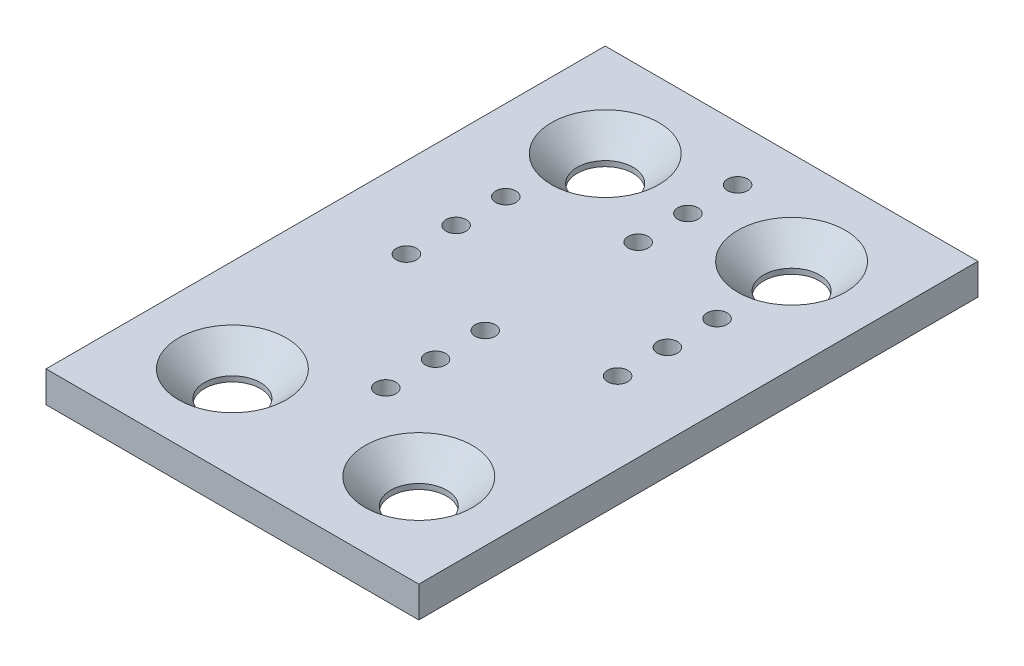
ISO-10303-21;
HEADER;
FILE_DESCRIPTION(('STEP AP214'),'2;1');
FILE_NAME('part.step','',(''),(''),'','','');
FILE_SCHEMA(('AUTOMOTIVE_DESIGN { 1 0 10303 214 1 1 1 1 }'));
ENDSEC;
DATA;
#1=APPLICATION_CONTEXT('core data for automotive mechanical design processes');
#2=APPLICATION_PROTOCOL_DEFINITION('international standard','automotive_design',2000,#1);
#3=PRODUCT_CONTEXT('',#1,'mechanical');
#4=PRODUCT('Part','Part','',(#3));
#5=PRODUCT_RELATED_PRODUCT_CATEGORY('part','',(#4));
#6=PRODUCT_DEFINITION_FORMATION('','',#4);
#7=PRODUCT_DEFINITION_CONTEXT('part definition',#1,'design');
#8=PRODUCT_DEFINITION('design','',#6,#7);
#9=PRODUCT_DEFINITION_SHAPE('','',#8);
#10=(LENGTH_UNIT() NAMED_UNIT(*) SI_UNIT(.MILLI.,.METRE.));
#11=(NAMED_UNIT(*) PLANE_ANGLE_UNIT() SI_UNIT($,.RADIAN.));
#12=(NAMED_UNIT(*) SI_UNIT($,.STERADIAN.) SOLID_ANGLE_UNIT());
#13=UNCERTAINTY_MEASURE_WITH_UNIT(LENGTH_MEASURE(1.E-05),#10,'distance_accuracy_value','');
#14=(GEOMETRIC_REPRESENTATION_CONTEXT(3) GLOBAL_UNCERTAINTY_ASSIGNED_CONTEXT((#13)) GLOBAL_UNIT_ASSIGNED_CONTEXT((#10,
#11,#12)) REPRESENTATION_CONTEXT('',''));
#15=CARTESIAN_POINT('',(0.,0.,0.));
#16=DIRECTION('',(0.,0.,1.));
#17=DIRECTION('',(1.,0.,0.));
#18=AXIS2_PLACEMENT_3D('',#15,#16,#17);
#19=CARTESIAN_POINT('',(0.,5.,45.));
#20=DIRECTION('',(0.,0.,-1.));
#21=DIRECTION('',(-1.,0.,0.));
#22=AXIS2_PLACEMENT_3D('',#19,#20,#21);
#23=PLANE('',#22);
#24=DIRECTION('',(1.,0.,0.));
#25=VECTOR('',#24,1.);
#26=CARTESIAN_POINT('',(0.,0.,45.));
#27=LINE('',#26,#25);
#28=CARTESIAN_POINT('',(-30.,0.,45.));
#29=VERTEX_POINT('',#28);
#30=CARTESIAN_POINT('',(30.,0.,45.));
#31=VERTEX_POINT('',#30);
#32=EDGE_CURVE('E159',#29,#31,#27,.T.);
#33=ORIENTED_EDGE('',*,*,#32,.T.);
#34=DIRECTION('',(0.,-1.,0.));
#35=VECTOR('',#34,1.);
#36=CARTESIAN_POINT('',(30.,5.,45.));
#37=LINE('',#36,#35);
#38=CARTESIAN_POINT('',(30.,5.,45.));
#39=VERTEX_POINT('',#38);
#40=EDGE_CURVE('E11',#39,#31,#37,.T.);
#41=ORIENTED_EDGE('',*,*,#40,.F.);
#42=DIRECTION('',(1.,0.,0.));
#43=VECTOR('',#42,1.);
#44=CARTESIAN_POINT('',(0.,5.,45.));
#45=LINE('',#44,#43);
#46=CARTESIAN_POINT('',(-30.,5.,45.));
#47=VERTEX_POINT('',#46);
#48=EDGE_CURVE('E92',#47,#39,#45,.T.);
#49=ORIENTED_EDGE('',*,*,#48,.F.);
#50=DIRECTION('',(0.,-1.,0.));
#51=VECTOR('',#50,1.);
#52=CARTESIAN_POINT('',(-30.,5.,45.));
#53=LINE('',#52,#51);
#54=EDGE_CURVE('E59',#47,#29,#53,.T.);
#55=ORIENTED_EDGE('',*,*,#54,.T.);
#56=EDGE_LOOP('',(#33,#41,#49,#55));
#57=FACE_BOUND('',#56,.T.);
#58=ADVANCED_FACE('F41',(#57),#23,.F.);
#59=CARTESIAN_POINT('',(30.,5.,0.));
#60=DIRECTION('',(-1.,0.,0.));
#61=DIRECTION('',(0.,0.,1.));
#62=AXIS2_PLACEMENT_3D('',#59,#60,#61);
#63=PLANE('',#62);
#64=DIRECTION('',(0.,0.,-1.));
#65=VECTOR('',#64,1.);
#66=CARTESIAN_POINT('',(30.,0.,0.));
#67=LINE('',#66,#65);
#68=CARTESIAN_POINT('',(30.,0.,-45.));
#69=VERTEX_POINT('',#68);
#70=EDGE_CURVE('E98',#31,#69,#67,.T.);
#71=ORIENTED_EDGE('',*,*,#70,.T.);
#72=DIRECTION('',(0.,-1.,0.));
#73=VECTOR('',#72,1.);
#74=CARTESIAN_POINT('',(30.,5.,-45.));
#75=LINE('',#74,#73);
#76=CARTESIAN_POINT('',(30.,5.,-45.));
#77=VERTEX_POINT('',#76);
#78=EDGE_CURVE('E51',#77,#69,#75,.T.);
#79=ORIENTED_EDGE('',*,*,#78,.F.);
#80=DIRECTION('',(0.,0.,-1.));
#81=VECTOR('',#80,1.);
#82=CARTESIAN_POINT('',(30.,5.,0.));
#83=LINE('',#82,#81);
#84=EDGE_CURVE('E84',#39,#77,#83,.T.);
#85=ORIENTED_EDGE('',*,*,#84,.F.);
#86=ORIENTED_EDGE('',*,*,#40,.T.);
#87=EDGE_LOOP('',(#71,#79,#85,#86));
#88=FACE_BOUND('',#87,.T.);
#89=ADVANCED_FACE('F97',(#88),#63,.F.);
#90=CARTESIAN_POINT('',(0.,5.,-45.));
#91=DIRECTION('',(0.,0.,-1.));
#92=DIRECTION('',(-1.,0.,0.));
#93=AXIS2_PLACEMENT_3D('',#90,#91,#92);
#94=PLANE('',#93);
#95=DIRECTION('',(1.,0.,0.));
#96=VECTOR('',#95,1.);
#97=CARTESIAN_POINT('',(0.,0.,-45.));
#98=LINE('',#97,#96);
#99=CARTESIAN_POINT('',(-30.,0.,-45.));
#100=VERTEX_POINT('',#99);
#101=EDGE_CURVE('E164',#100,#69,#98,.T.);
#102=ORIENTED_EDGE('',*,*,#101,.F.);
#103=DIRECTION('',(0.,-1.,0.));
#104=VECTOR('',#103,1.);
#105=CARTESIAN_POINT('',(-30.,5.,-45.));
#106=LINE('',#105,#104);
#107=CARTESIAN_POINT('',(-30.,5.,-45.));
#108=VERTEX_POINT('',#107);
#109=EDGE_CURVE('E73',#108,#100,#106,.T.);
#110=ORIENTED_EDGE('',*,*,#109,.F.);
#111=DIRECTION('',(1.,0.,0.));
#112=VECTOR('',#111,1.);
#113=CARTESIAN_POINT('',(0.,5.,-45.));
#114=LINE('',#113,#112);
#115=EDGE_CURVE('E91',#108,#77,#114,.T.);
#116=ORIENTED_EDGE('',*,*,#115,.T.);
#117=ORIENTED_EDGE('',*,*,#78,.T.);
#118=EDGE_LOOP('',(#102,#110,#116,#117));
#119=FACE_BOUND('',#118,.T.);
#120=ADVANCED_FACE('F102',(#119),#94,.T.);
#121=CARTESIAN_POINT('',(0.,5.,-28.3090687587975));
#122=DIRECTION('',(0.,-1.,0.));
#123=DIRECTION('',(0.,0.,-1.));
#124=AXIS2_PLACEMENT_3D('',#121,#122,#123);
#125=CYLINDRICAL_SURFACE('',#124,1.625);
#126=CARTESIAN_POINT('',(0.,5.,-28.3090687587975));
#127=DIRECTION('',(0.,1.,0.));
#128=DIRECTION('',(0.,0.,1.));
#129=AXIS2_PLACEMENT_3D('',#126,#127,#128);
#130=CIRCLE('',#129,1.625);
#131=CARTESIAN_POINT('',(0.,5.,-26.6840687587975));
#132=VERTEX_POINT('',#131);
#133=EDGE_CURVE('E224',#132,#132,#130,.T.);
#134=ORIENTED_EDGE('',*,*,#133,.T.);
#135=EDGE_LOOP('',(#134));
#136=FACE_BOUND('',#135,.T.);
#137=CARTESIAN_POINT('',(0.,0.,-28.3090687587975));
#138=DIRECTION('',(0.,1.,0.));
#139=DIRECTION('',(0.,0.,1.));
#140=AXIS2_PLACEMENT_3D('',#137,#138,#139);
#141=CIRCLE('',#140,1.625);
#142=CARTESIAN_POINT('',(0.,0.,-26.6840687587975));
#143=VERTEX_POINT('',#142);
#144=EDGE_CURVE('E155',#143,#143,#141,.T.);
#145=ORIENTED_EDGE('',*,*,#144,.F.);
#146=EDGE_LOOP('',(#145));
#147=FACE_BOUND('',#146,.T.);
#148=ADVANCED_FACE('F230',(#136,#147),#125,.F.);
#149=CARTESIAN_POINT('',(17.,5.,-8.));
#150=DIRECTION('',(0.,-1.,0.));
#151=DIRECTION('',(0.,0.,-1.));
#152=AXIS2_PLACEMENT_3D('',#149,#150,#151);
#153=CYLINDRICAL_SURFACE('',#152,1.625);
#154=CARTESIAN_POINT('',(17.,5.,-8.));
#155=DIRECTION('',(0.,1.,0.));
#156=DIRECTION('',(0.,0.,1.));
#157=AXIS2_PLACEMENT_3D('',#154,#155,#156);
#158=CIRCLE('',#157,1.625);
#159=CARTESIAN_POINT('',(17.,5.,-6.375));
#160=VERTEX_POINT('',#159);
#161=EDGE_CURVE('E220',#160,#160,#158,.T.);
#162=ORIENTED_EDGE('',*,*,#161,.T.);
#163=EDGE_LOOP('',(#162));
#164=FACE_BOUND('',#163,.T.);
#165=CARTESIAN_POINT('',(17.,0.,-8.));
#166=DIRECTION('',(0.,1.,0.));
#167=DIRECTION('',(0.,0.,1.));
#168=AXIS2_PLACEMENT_3D('',#165,#166,#167);
#169=CIRCLE('',#168,1.625);
#170=CARTESIAN_POINT('',(17.,0.,-6.375));
#171=VERTEX_POINT('',#170);
#172=EDGE_CURVE('E151',#171,#171,#169,.T.);
#173=ORIENTED_EDGE('',*,*,#172,.F.);
#174=EDGE_LOOP('',(#173));
#175=FACE_BOUND('',#174,.T.);
#176=ADVANCED_FACE('F259',(#164,#175),#153,.F.);
#177=CARTESIAN_POINT('',(-17.,5.,-8.));
#178=DIRECTION('',(0.,-1.,0.));
#179=DIRECTION('',(0.,0.,-1.));
#180=AXIS2_PLACEMENT_3D('',#177,#178,#179);
#181=CYLINDRICAL_SURFACE('',#180,1.625);
#182=CARTESIAN_POINT('',(-17.,5.,-8.));
#183=DIRECTION('',(0.,1.,0.));
#184=DIRECTION('',(0.,0.,1.));
#185=AXIS2_PLACEMENT_3D('',#182,#183,#184);
#186=CIRCLE('',#185,1.625);
#187=CARTESIAN_POINT('',(-17.,5.,-6.375));
#188=VERTEX_POINT('',#187);
#189=EDGE_CURVE('E216',#188,#188,#186,.T.);
#190=ORIENTED_EDGE('',*,*,#189,.T.);
#191=EDGE_LOOP('',(#190));
#192=FACE_BOUND('',#191,.T.);
#193=CARTESIAN_POINT('',(-17.,0.,-8.));
#194=DIRECTION('',(0.,1.,0.));
#195=DIRECTION('',(0.,0.,1.));
#196=AXIS2_PLACEMENT_3D('',#193,#194,#195);
#197=CIRCLE('',#196,1.625);
#198=CARTESIAN_POINT('',(-17.,0.,-6.375));
#199=VERTEX_POINT('',#198);
#200=EDGE_CURVE('E147',#199,#199,#197,.T.);
#201=ORIENTED_EDGE('',*,*,#200,.F.);
#202=EDGE_LOOP('',(#201));
#203=FACE_BOUND('',#202,.T.);
#204=ADVANCED_FACE('F262',(#192,#203),#181,.F.);
#205=CARTESIAN_POINT('',(0.,5.,-36.3090687587975));
#206=DIRECTION('',(0.,-1.,0.));
#207=DIRECTION('',(0.,0.,-1.));
#208=AXIS2_PLACEMENT_3D('',#205,#206,#207);
#209=CYLINDRICAL_SURFACE('',#208,1.625);
#210=CARTESIAN_POINT('',(0.,5.,-36.3090687587975));
#211=DIRECTION('',(0.,1.,0.));
#212=DIRECTION('',(0.,0.,1.));
#213=AXIS2_PLACEMENT_3D('',#210,#211,#212);
#214=CIRCLE('',#213,1.625);
#215=CARTESIAN_POINT('',(0.,5.,-34.6840687587975));
#216=VERTEX_POINT('',#215);
#217=EDGE_CURVE('E212',#216,#216,#214,.T.);
#218=ORIENTED_EDGE('',*,*,#217,.T.);
#219=EDGE_LOOP('',(#218));
#220=FACE_BOUND('',#219,.T.);
#221=CARTESIAN_POINT('',(0.,0.,-36.3090687587975));
#222=DIRECTION('',(0.,1.,0.));
#223=DIRECTION('',(0.,0.,1.));
#224=AXIS2_PLACEMENT_3D('',#221,#222,#223);
#225=CIRCLE('',#224,1.625);
#226=CARTESIAN_POINT('',(0.,0.,-34.6840687587975));
#227=VERTEX_POINT('',#226);
#228=EDGE_CURVE('E143',#227,#227,#225,.T.);
#229=ORIENTED_EDGE('',*,*,#228,.F.);
#230=EDGE_LOOP('',(#229));
#231=FACE_BOUND('',#230,.T.);
#232=ADVANCED_FACE('F266',(#220,#231),#209,.F.);
#233=CARTESIAN_POINT('',(16.9999999999999,5.,-16.));
#234=DIRECTION('',(0.,-1.,0.));
#235=DIRECTION('',(0.,0.,-1.));
#236=AXIS2_PLACEMENT_3D('',#233,#234,#235);
#237=CYLINDRICAL_SURFACE('',#236,1.625);
#238=CARTESIAN_POINT('',(16.9999999999999,5.,-16.));
#239=DIRECTION('',(0.,1.,0.));
#240=DIRECTION('',(0.,0.,1.));
#241=AXIS2_PLACEMENT_3D('',#238,#239,#240);
#242=CIRCLE('',#241,1.625);
#243=CARTESIAN_POINT('',(16.9999999999999,5.,-14.375));
#244=VERTEX_POINT('',#243);
#245=EDGE_CURVE('E208',#244,#244,#242,.T.);
#246=ORIENTED_EDGE('',*,*,#245,.T.);
#247=EDGE_LOOP('',(#246));
#248=FACE_BOUND('',#247,.T.);
#249=CARTESIAN_POINT('',(16.9999999999999,0.,-16.));
#250=DIRECTION('',(0.,1.,0.));
#251=DIRECTION('',(0.,0.,1.));
#252=AXIS2_PLACEMENT_3D('',#249,#250,#251);
#253=CIRCLE('',#252,1.625);
#254=CARTESIAN_POINT('',(16.9999999999999,0.,-14.375));
#255=VERTEX_POINT('',#254);
#256=EDGE_CURVE('E139',#255,#255,#253,.T.);
#257=ORIENTED_EDGE('',*,*,#256,.F.);
#258=EDGE_LOOP('',(#257));
#259=FACE_BOUND('',#258,.T.);
#260=ADVANCED_FACE('F270',(#248,#259),#237,.F.);
#261=CARTESIAN_POINT('',(-17.0000000000001,5.,-16.));
#262=DIRECTION('',(0.,-1.,0.));
#263=DIRECTION('',(0.,0.,-1.));
#264=AXIS2_PLACEMENT_3D('',#261,#262,#263);
#265=CYLINDRICAL_SURFACE('',#264,1.625);
#266=CARTESIAN_POINT('',(-17.0000000000001,5.,-16.));
#267=DIRECTION('',(0.,1.,0.));
#268=DIRECTION('',(0.,0.,1.));
#269=AXIS2_PLACEMENT_3D('',#266,#267,#268);
#270=CIRCLE('',#269,1.625);
#271=CARTESIAN_POINT('',(-17.0000000000001,5.,-14.375));
#272=VERTEX_POINT('',#271);
#273=EDGE_CURVE('E204',#272,#272,#270,.T.);
#274=ORIENTED_EDGE('',*,*,#273,.T.);
#275=EDGE_LOOP('',(#274));
#276=FACE_BOUND('',#275,.T.);
#277=CARTESIAN_POINT('',(-17.0000000000001,0.,-16.));
#278=DIRECTION('',(0.,1.,0.));
#279=DIRECTION('',(0.,0.,1.));
#280=AXIS2_PLACEMENT_3D('',#277,#278,#279);
#281=CIRCLE('',#280,1.625);
#282=CARTESIAN_POINT('',(-17.0000000000001,0.,-14.375));
#283=VERTEX_POINT('',#282);
#284=EDGE_CURVE('E135',#283,#283,#281,.T.);
#285=ORIENTED_EDGE('',*,*,#284,.F.);
#286=EDGE_LOOP('',(#285));
#287=FACE_BOUND('',#286,.T.);
#288=ADVANCED_FACE('F274',(#276,#287),#265,.F.);
#289=CARTESIAN_POINT('',(0.,5.,-20.3090687587975));
#290=DIRECTION('',(0.,-1.,0.));
#291=DIRECTION('',(0.,0.,-1.));
#292=AXIS2_PLACEMENT_3D('',#289,#290,#291);
#293=CYLINDRICAL_SURFACE('',#292,1.625);
#294=CARTESIAN_POINT('',(0.,5.,-20.3090687587975));
#295=DIRECTION('',(0.,1.,0.));
#296=DIRECTION('',(0.,0.,1.));
#297=AXIS2_PLACEMENT_3D('',#294,#295,#296);
#298=CIRCLE('',#297,1.625);
#299=CARTESIAN_POINT('',(0.,5.,-18.6840687587975));
#300=VERTEX_POINT('',#299);
#301=EDGE_CURVE('E200',#300,#300,#298,.T.);
#302=ORIENTED_EDGE('',*,*,#301,.T.);
#303=EDGE_LOOP('',(#302));
#304=FACE_BOUND('',#303,.T.);
#305=CARTESIAN_POINT('',(0.,0.,-20.3090687587975));
#306=DIRECTION('',(0.,1.,0.));
#307=DIRECTION('',(0.,0.,1.));
#308=AXIS2_PLACEMENT_3D('',#305,#306,#307);
#309=CIRCLE('',#308,1.625);
#310=CARTESIAN_POINT('',(0.,0.,-18.6840687587975));
#311=VERTEX_POINT('',#310);
#312=EDGE_CURVE('E131',#311,#311,#309,.T.);
#313=ORIENTED_EDGE('',*,*,#312,.F.);
#314=EDGE_LOOP('',(#313));
#315=FACE_BOUND('',#314,.T.);
#316=ADVANCED_FACE('F278',(#304,#315),#293,.F.);
#317=CARTESIAN_POINT('',(17.,5.,0.));
#318=DIRECTION('',(0.,-1.,0.));
#319=DIRECTION('',(0.,0.,-1.));
#320=AXIS2_PLACEMENT_3D('',#317,#318,#319);
#321=CYLINDRICAL_SURFACE('',#320,1.625);
#322=CARTESIAN_POINT('',(17.,5.,0.));
#323=DIRECTION('',(0.,1.,0.));
#324=DIRECTION('',(0.,0.,1.));
#325=AXIS2_PLACEMENT_3D('',#322,#323,#324);
#326=CIRCLE('',#325,1.625);
#327=CARTESIAN_POINT('',(17.,5.,1.625));
#328=VERTEX_POINT('',#327);
#329=EDGE_CURVE('E196',#328,#328,#326,.T.);
#330=ORIENTED_EDGE('',*,*,#329,.T.);
#331=EDGE_LOOP('',(#330));
#332=FACE_BOUND('',#331,.T.);
#333=CARTESIAN_POINT('',(17.,0.,0.));
#334=DIRECTION('',(0.,1.,0.));
#335=DIRECTION('',(0.,0.,1.));
#336=AXIS2_PLACEMENT_3D('',#333,#334,#335);
#337=CIRCLE('',#336,1.625);
#338=CARTESIAN_POINT('',(17.,0.,1.625));
#339=VERTEX_POINT('',#338);
#340=EDGE_CURVE('E127',#339,#339,#337,.T.);
#341=ORIENTED_EDGE('',*,*,#340,.F.);
#342=EDGE_LOOP('',(#341));
#343=FACE_BOUND('',#342,.T.);
#344=ADVANCED_FACE('F282',(#332,#343),#321,.F.);
#345=CARTESIAN_POINT('',(-17.,5.,0.));
#346=DIRECTION('',(0.,-1.,0.));
#347=DIRECTION('',(0.,0.,-1.));
#348=AXIS2_PLACEMENT_3D('',#345,#346,#347);
#349=CYLINDRICAL_SURFACE('',#348,1.625);
#350=CARTESIAN_POINT('',(-17.,5.,0.));
#351=DIRECTION('',(0.,1.,0.));
#352=DIRECTION('',(0.,0.,1.));
#353=AXIS2_PLACEMENT_3D('',#350,#351,#352);
#354=CIRCLE('',#353,1.625);
#355=CARTESIAN_POINT('',(-17.,5.,1.625));
#356=VERTEX_POINT('',#355);
#357=EDGE_CURVE('E192',#356,#356,#354,.T.);
#358=ORIENTED_EDGE('',*,*,#357,.T.);
#359=EDGE_LOOP('',(#358));
#360=FACE_BOUND('',#359,.T.);
#361=CARTESIAN_POINT('',(-17.,0.,0.));
#362=DIRECTION('',(0.,1.,0.));
#363=DIRECTION('',(0.,0.,1.));
#364=AXIS2_PLACEMENT_3D('',#361,#362,#363);
#365=CIRCLE('',#364,1.625);
#366=CARTESIAN_POINT('',(-17.,0.,1.625));
#367=VERTEX_POINT('',#366);
#368=EDGE_CURVE('E123',#367,#367,#365,.T.);
#369=ORIENTED_EDGE('',*,*,#368,.F.);
#370=EDGE_LOOP('',(#369));
#371=FACE_BOUND('',#370,.T.);
#372=ADVANCED_FACE('F286',(#360,#371),#349,.F.);
#373=CARTESIAN_POINT('',(0.,5.,4.3090687587975));
#374=DIRECTION('',(0.,-1.,0.));
#375=DIRECTION('',(0.,0.,-1.));
#376=AXIS2_PLACEMENT_3D('',#373,#374,#375);
#377=CYLINDRICAL_SURFACE('',#376,1.625);
#378=CARTESIAN_POINT('',(0.,5.,4.3090687587975));
#379=DIRECTION('',(0.,1.,0.));
#380=DIRECTION('',(0.,0.,1.));
#381=AXIS2_PLACEMENT_3D('',#378,#379,#380);
#382=CIRCLE('',#381,1.625);
#383=CARTESIAN_POINT('',(0.,5.,5.9340687587975));
#384=VERTEX_POINT('',#383);
#385=EDGE_CURVE('E184',#384,#384,#382,.T.);
#386=ORIENTED_EDGE('',*,*,#385,.T.);
#387=EDGE_LOOP('',(#386));
#388=FACE_BOUND('',#387,.T.);
#389=CARTESIAN_POINT('',(0.,0.,4.3090687587975));
#390=DIRECTION('',(0.,1.,0.));
#391=DIRECTION('',(0.,0.,1.));
#392=AXIS2_PLACEMENT_3D('',#389,#390,#391);
#393=CIRCLE('',#392,1.625);
#394=CARTESIAN_POINT('',(0.,0.,5.9340687587975));
#395=VERTEX_POINT('',#394);
#396=EDGE_CURVE('E119',#395,#395,#393,.T.);
#397=ORIENTED_EDGE('',*,*,#396,.F.);
#398=EDGE_LOOP('',(#397));
#399=FACE_BOUND('',#398,.T.);
#400=ADVANCED_FACE('F290',(#388,#399),#377,.F.);
#401=CARTESIAN_POINT('',(0.,5.,20.3090687587975));
#402=DIRECTION('',(0.,-1.,0.));
#403=DIRECTION('',(0.,0.,-1.));
#404=AXIS2_PLACEMENT_3D('',#401,#402,#403);
#405=CYLINDRICAL_SURFACE('',#404,1.625);
#406=CARTESIAN_POINT('',(0.,5.,20.3090687587975));
#407=DIRECTION('',(0.,1.,0.));
#408=DIRECTION('',(0.,0.,1.));
#409=AXIS2_PLACEMENT_3D('',#406,#407,#408);
#410=CIRCLE('',#409,1.625);
#411=CARTESIAN_POINT('',(0.,5.,21.9340687587975));
#412=VERTEX_POINT('',#411);
#413=EDGE_CURVE('E178',#412,#412,#410,.T.);
#414=ORIENTED_EDGE('',*,*,#413,.T.);
#415=EDGE_LOOP('',(#414));
#416=FACE_BOUND('',#415,.T.);
#417=CARTESIAN_POINT('',(0.,0.,20.3090687587975));
#418=DIRECTION('',(0.,1.,0.));
#419=DIRECTION('',(0.,0.,1.));
#420=AXIS2_PLACEMENT_3D('',#417,#418,#419);
#421=CIRCLE('',#420,1.625);
#422=CARTESIAN_POINT('',(0.,0.,21.9340687587975));
#423=VERTEX_POINT('',#422);
#424=EDGE_CURVE('E114',#423,#423,#421,.T.);
#425=ORIENTED_EDGE('',*,*,#424,.F.);
#426=EDGE_LOOP('',(#425));
#427=FACE_BOUND('',#426,.T.);
#428=ADVANCED_FACE('F293',(#416,#427),#405,.F.);
#429=CARTESIAN_POINT('',(0.,5.,12.3090687587975));
#430=DIRECTION('',(0.,-1.,0.));
#431=DIRECTION('',(0.,0.,-1.));
#432=AXIS2_PLACEMENT_3D('',#429,#430,#431);
#433=CYLINDRICAL_SURFACE('',#432,1.625);
#434=CARTESIAN_POINT('',(0.,5.,12.3090687587975));
#435=DIRECTION('',(0.,1.,0.));
#436=DIRECTION('',(0.,0.,1.));
#437=AXIS2_PLACEMENT_3D('',#434,#435,#436);
#438=CIRCLE('',#437,1.625);
#439=CARTESIAN_POINT('',(0.,5.,13.9340687587975));
#440=VERTEX_POINT('',#439);
#441=EDGE_CURVE('E171',#440,#440,#438,.T.);
#442=ORIENTED_EDGE('',*,*,#441,.T.);
#443=EDGE_LOOP('',(#442));
#444=FACE_BOUND('',#443,.T.);
#445=CARTESIAN_POINT('',(0.,0.,12.3090687587975));
#446=DIRECTION('',(0.,1.,0.));
#447=DIRECTION('',(0.,0.,1.));
#448=AXIS2_PLACEMENT_3D('',#445,#446,#447);
#449=CIRCLE('',#448,1.625);
#450=CARTESIAN_POINT('',(0.,0.,13.9340687587975));
#451=VERTEX_POINT('',#450);
#452=EDGE_CURVE('E110',#451,#451,#449,.T.);
#453=ORIENTED_EDGE('',*,*,#452,.F.);
#454=EDGE_LOOP('',(#453));
#455=FACE_BOUND('',#454,.T.);
#456=ADVANCED_FACE('F43',(#444,#455),#433,.F.);
#457=CARTESIAN_POINT('',(-30.,5.,0.));
#458=DIRECTION('',(-1.,0.,0.));
#459=DIRECTION('',(0.,0.,1.));
#460=AXIS2_PLACEMENT_3D('',#457,#458,#459);
#461=PLANE('',#460);
#462=DIRECTION('',(0.,0.,-1.));
#463=VECTOR('',#462,1.);
#464=CARTESIAN_POINT('',(-30.,0.,0.));
#465=LINE('',#464,#463);
#466=EDGE_CURVE('E167',#29,#100,#465,.T.);
#467=ORIENTED_EDGE('',*,*,#466,.F.);
#468=ORIENTED_EDGE('',*,*,#54,.F.);
#469=DIRECTION('',(0.,0.,-1.));
#470=VECTOR('',#469,1.);
#471=CARTESIAN_POINT('',(-30.,5.,0.));
#472=LINE('',#471,#470);
#473=EDGE_CURVE('E104',#47,#108,#472,.T.);
#474=ORIENTED_EDGE('',*,*,#473,.T.);
#475=ORIENTED_EDGE('',*,*,#109,.T.);
#476=EDGE_LOOP('',(#467,#468,#474,#475));
#477=FACE_BOUND('',#476,.T.);
#478=ADVANCED_FACE('F235',(#477),#461,.T.);
#479=CARTESIAN_POINT('',(0.,5.,0.));
#480=DIRECTION('',(0.,1.,0.));
#481=DIRECTION('',(0.,0.,1.));
#482=AXIS2_PLACEMENT_3D('',#479,#480,#481);
#483=PLANE('',#482);
#484=CARTESIAN_POINT('',(-15.,5.,30.));
#485=DIRECTION('',(0.,1.,0.));
#486=DIRECTION('',(0.,0.,1.));
#487=AXIS2_PLACEMENT_3D('',#484,#485,#486);
#488=CIRCLE('',#487,8.65);
#489=CARTESIAN_POINT('',(-15.,5.,38.65));
#490=VERTEX_POINT('',#489);
#491=EDGE_CURVE('E458',#490,#490,#488,.T.);
#492=ORIENTED_EDGE('',*,*,#491,.F.);
#493=EDGE_LOOP('',(#492));
#494=FACE_BOUND('',#493,.T.);
#495=CARTESIAN_POINT('',(15.,5.,30.));
#496=DIRECTION('',(0.,1.,0.));
#497=DIRECTION('',(0.,0.,1.));
#498=AXIS2_PLACEMENT_3D('',#495,#496,#497);
#499=CIRCLE('',#498,8.65);
#500=CARTESIAN_POINT('',(15.,5.,38.65));
#501=VERTEX_POINT('',#500);
#502=EDGE_CURVE('E468',#501,#501,#499,.T.);
#503=ORIENTED_EDGE('',*,*,#502,.F.);
#504=EDGE_LOOP('',(#503));
#505=FACE_BOUND('',#504,.T.);
#506=CARTESIAN_POINT('',(-15.,5.,-30.));
#507=DIRECTION('',(0.,1.,0.));
#508=DIRECTION('',(0.,0.,1.));
#509=AXIS2_PLACEMENT_3D('',#506,#507,#508);
#510=CIRCLE('',#509,8.65);
#511=CARTESIAN_POINT('',(-15.,5.,-21.35));
#512=VERTEX_POINT('',#511);
#513=EDGE_CURVE('E480',#512,#512,#510,.T.);
#514=ORIENTED_EDGE('',*,*,#513,.F.);
#515=EDGE_LOOP('',(#514));
#516=FACE_BOUND('',#515,.T.);
#517=CARTESIAN_POINT('',(15.,5.,-30.));
#518=DIRECTION('',(0.,1.,0.));
#519=DIRECTION('',(0.,0.,1.));
#520=AXIS2_PLACEMENT_3D('',#517,#518,#519);
#521=CIRCLE('',#520,8.65);
#522=CARTESIAN_POINT('',(15.,5.,-21.35));
#523=VERTEX_POINT('',#522);
#524=EDGE_CURVE('E492',#523,#523,#521,.T.);
#525=ORIENTED_EDGE('',*,*,#524,.F.);
#526=EDGE_LOOP('',(#525));
#527=FACE_BOUND('',#526,.T.);
#528=ORIENTED_EDGE('',*,*,#441,.F.);
#529=EDGE_LOOP('',(#528));
#530=FACE_BOUND('',#529,.T.);
#531=ORIENTED_EDGE('',*,*,#413,.F.);
#532=EDGE_LOOP('',(#531));
#533=FACE_BOUND('',#532,.T.);
#534=ORIENTED_EDGE('',*,*,#385,.F.);
#535=EDGE_LOOP('',(#534));
#536=FACE_BOUND('',#535,.T.);
#537=ORIENTED_EDGE('',*,*,#357,.F.);
#538=EDGE_LOOP('',(#537));
#539=FACE_BOUND('',#538,.T.);
#540=ORIENTED_EDGE('',*,*,#329,.F.);
#541=EDGE_LOOP('',(#540));
#542=FACE_BOUND('',#541,.T.);
#543=ORIENTED_EDGE('',*,*,#301,.F.);
#544=EDGE_LOOP('',(#543));
#545=FACE_BOUND('',#544,.T.);
#546=ORIENTED_EDGE('',*,*,#273,.F.);
#547=EDGE_LOOP('',(#546));
#548=FACE_BOUND('',#547,.T.);
#549=ORIENTED_EDGE('',*,*,#245,.F.);
#550=EDGE_LOOP('',(#549));
#551=FACE_BOUND('',#550,.T.);
#552=ORIENTED_EDGE('',*,*,#217,.F.);
#553=EDGE_LOOP('',(#552));
#554=FACE_BOUND('',#553,.T.);
#555=ORIENTED_EDGE('',*,*,#189,.F.);
#556=EDGE_LOOP('',(#555));
#557=FACE_BOUND('',#556,.T.);
#558=ORIENTED_EDGE('',*,*,#161,.F.);
#559=EDGE_LOOP('',(#558));
#560=FACE_BOUND('',#559,.T.);
#561=ORIENTED_EDGE('',*,*,#133,.F.);
#562=EDGE_LOOP('',(#561));
#563=FACE_BOUND('',#562,.T.);
#564=ORIENTED_EDGE('',*,*,#48,.T.);
#565=ORIENTED_EDGE('',*,*,#84,.T.);
#566=ORIENTED_EDGE('',*,*,#115,.F.);
#567=ORIENTED_EDGE('',*,*,#473,.F.);
#568=EDGE_LOOP('',(#564,#565,#566,#567));
#569=FACE_BOUND('',#568,.T.);
#570=ADVANCED_FACE('F88',(#494,#505,#516,#527,#530,#533,#536,#539,#542,#545,#548,#551,#554,#557,
#560,#563,#569),#483,.T.);
#571=CARTESIAN_POINT('',(0.,0.,0.));
#572=DIRECTION('',(0.,1.,0.));
#573=DIRECTION('',(0.,0.,1.));
#574=AXIS2_PLACEMENT_3D('',#571,#572,#573);
#575=PLANE('',#574);
#576=CARTESIAN_POINT('',(-15.,0.,30.));
#577=DIRECTION('',(0.,1.,0.));
#578=DIRECTION('',(0.,0.,1.));
#579=AXIS2_PLACEMENT_3D('',#576,#577,#578);
#580=CIRCLE('',#579,4.5);
#581=CARTESIAN_POINT('',(-15.,0.,34.5));
#582=VERTEX_POINT('',#581);
#583=EDGE_CURVE('E462',#582,#582,#580,.T.);
#584=ORIENTED_EDGE('',*,*,#583,.T.);
#585=EDGE_LOOP('',(#584));
#586=FACE_BOUND('',#585,.T.);
#587=CARTESIAN_POINT('',(15.,0.,30.));
#588=DIRECTION('',(0.,1.,0.));
#589=DIRECTION('',(0.,0.,1.));
#590=AXIS2_PLACEMENT_3D('',#587,#588,#589);
#591=CIRCLE('',#590,4.5);
#592=CARTESIAN_POINT('',(15.,0.,34.5));
#593=VERTEX_POINT('',#592);
#594=EDGE_CURVE('E476',#593,#593,#591,.T.);
#595=ORIENTED_EDGE('',*,*,#594,.T.);
#596=EDGE_LOOP('',(#595));
#597=FACE_BOUND('',#596,.T.);
#598=CARTESIAN_POINT('',(-15.,0.,-30.));
#599=DIRECTION('',(0.,1.,0.));
#600=DIRECTION('',(0.,0.,1.));
#601=AXIS2_PLACEMENT_3D('',#598,#599,#600);
#602=CIRCLE('',#601,4.5);
#603=CARTESIAN_POINT('',(-15.,0.,-25.5));
#604=VERTEX_POINT('',#603);
#605=EDGE_CURVE('E488',#604,#604,#602,.T.);
#606=ORIENTED_EDGE('',*,*,#605,.T.);
#607=EDGE_LOOP('',(#606));
#608=FACE_BOUND('',#607,.T.);
#609=CARTESIAN_POINT('',(15.,0.,-30.));
#610=DIRECTION('',(0.,1.,0.));
#611=DIRECTION('',(0.,0.,1.));
#612=AXIS2_PLACEMENT_3D('',#609,#610,#611);
#613=CIRCLE('',#612,4.5);
#614=CARTESIAN_POINT('',(15.,0.,-25.5));
#615=VERTEX_POINT('',#614);
#616=EDGE_CURVE('E115',#615,#615,#613,.T.);
#617=ORIENTED_EDGE('',*,*,#616,.T.);
#618=EDGE_LOOP('',(#617));
#619=FACE_BOUND('',#618,.T.);
#620=ORIENTED_EDGE('',*,*,#452,.T.);
#621=EDGE_LOOP('',(#620));
#622=FACE_BOUND('',#621,.T.);
#623=ORIENTED_EDGE('',*,*,#424,.T.);
#624=EDGE_LOOP('',(#623));
#625=FACE_BOUND('',#624,.T.);
#626=ORIENTED_EDGE('',*,*,#396,.T.);
#627=EDGE_LOOP('',(#626));
#628=FACE_BOUND('',#627,.T.);
#629=ORIENTED_EDGE('',*,*,#368,.T.);
#630=EDGE_LOOP('',(#629));
#631=FACE_BOUND('',#630,.T.);
#632=ORIENTED_EDGE('',*,*,#340,.T.);
#633=EDGE_LOOP('',(#632));
#634=FACE_BOUND('',#633,.T.);
#635=ORIENTED_EDGE('',*,*,#312,.T.);
#636=EDGE_LOOP('',(#635));
#637=FACE_BOUND('',#636,.T.);
#638=ORIENTED_EDGE('',*,*,#284,.T.);
#639=EDGE_LOOP('',(#638));
#640=FACE_BOUND('',#639,.T.);
#641=ORIENTED_EDGE('',*,*,#256,.T.);
#642=EDGE_LOOP('',(#641));
#643=FACE_BOUND('',#642,.T.);
#644=ORIENTED_EDGE('',*,*,#228,.T.);
#645=EDGE_LOOP('',(#644));
#646=FACE_BOUND('',#645,.T.);
#647=ORIENTED_EDGE('',*,*,#200,.T.);
#648=EDGE_LOOP('',(#647));
#649=FACE_BOUND('',#648,.T.);
#650=ORIENTED_EDGE('',*,*,#172,.T.);
#651=EDGE_LOOP('',(#650));
#652=FACE_BOUND('',#651,.T.);
#653=ORIENTED_EDGE('',*,*,#144,.T.);
#654=EDGE_LOOP('',(#653));
#655=FACE_BOUND('',#654,.T.);
#656=ORIENTED_EDGE('',*,*,#32,.F.);
#657=ORIENTED_EDGE('',*,*,#466,.T.);
#658=ORIENTED_EDGE('',*,*,#101,.T.);
#659=ORIENTED_EDGE('',*,*,#70,.F.);
#660=EDGE_LOOP('',(#656,#657,#658,#659));
#661=FACE_BOUND('',#660,.T.);
#662=ADVANCED_FACE('F234',(#586,#597,#608,#619,#622,#625,#628,#631,#634,#637,#640,#643,#646,
#649,#652,#655,#661),#575,.F.);
#663=CARTESIAN_POINT('',(15.,5.,-30.));
#664=DIRECTION('',(0.,1.,0.));
#665=DIRECTION('',(0.,0.,1.));
#666=AXIS2_PLACEMENT_3D('',#663,#664,#665);
#667=CYLINDRICAL_SURFACE('',#666,4.5);
#668=ORIENTED_EDGE('',*,*,#616,.F.);
#669=EDGE_LOOP('',(#668));
#670=FACE_BOUND('',#669,.T.);
#671=CARTESIAN_POINT('',(15.,0.850000000000001,-30.));
#672=DIRECTION('',(0.,1.,0.));
#673=DIRECTION('',(0.,0.,1.));
#674=AXIS2_PLACEMENT_3D('',#671,#672,#673);
#675=CIRCLE('',#674,4.5);
#676=CARTESIAN_POINT('',(15.,0.850000000000001,-25.5));
#677=VERTEX_POINT('',#676);
#678=EDGE_CURVE('E495',#677,#677,#675,.T.);
#679=ORIENTED_EDGE('',*,*,#678,.T.);
#680=EDGE_LOOP('',(#679));
#681=FACE_BOUND('',#680,.T.);
#682=ADVANCED_FACE('F242',(#670,#681),#667,.F.);
#683=CARTESIAN_POINT('',(15.,5.,-30.));
#684=DIRECTION('',(0.,1.,0.));
#685=DIRECTION('',(0.,0.,1.));
#686=AXIS2_PLACEMENT_3D('',#683,#684,#685);
#687=CONICAL_SURFACE('',#686,8.65,0.785398163397448);
#688=ORIENTED_EDGE('',*,*,#678,.F.);
#689=EDGE_LOOP('',(#688));
#690=FACE_BOUND('',#689,.T.);
#691=ORIENTED_EDGE('',*,*,#524,.T.);
#692=EDGE_LOOP('',(#691));
#693=FACE_BOUND('',#692,.T.);
#694=ADVANCED_FACE('F380',(#690,#693),#687,.F.);
#695=CARTESIAN_POINT('',(-15.,5.,-30.));
#696=DIRECTION('',(0.,1.,0.));
#697=DIRECTION('',(0.,0.,1.));
#698=AXIS2_PLACEMENT_3D('',#695,#696,#697);
#699=CYLINDRICAL_SURFACE('',#698,4.5);
#700=ORIENTED_EDGE('',*,*,#605,.F.);
#701=EDGE_LOOP('',(#700));
#702=FACE_BOUND('',#701,.T.);
#703=CARTESIAN_POINT('',(-15.,0.850000000000001,-30.));
#704=DIRECTION('',(0.,1.,0.));
#705=DIRECTION('',(0.,0.,1.));
#706=AXIS2_PLACEMENT_3D('',#703,#704,#705);
#707=CIRCLE('',#706,4.5);
#708=CARTESIAN_POINT('',(-15.,0.850000000000001,-25.5));
#709=VERTEX_POINT('',#708);
#710=EDGE_CURVE('E484',#709,#709,#707,.T.);
#711=ORIENTED_EDGE('',*,*,#710,.T.);
#712=EDGE_LOOP('',(#711));
#713=FACE_BOUND('',#712,.T.);
#714=ADVANCED_FACE('F389',(#702,#713),#699,.F.);
#715=CARTESIAN_POINT('',(-15.,5.,-30.));
#716=DIRECTION('',(0.,1.,0.));
#717=DIRECTION('',(0.,0.,1.));
#718=AXIS2_PLACEMENT_3D('',#715,#716,#717);
#719=CONICAL_SURFACE('',#718,8.65,0.785398163397448);
#720=ORIENTED_EDGE('',*,*,#710,.F.);
#721=EDGE_LOOP('',(#720));
#722=FACE_BOUND('',#721,.T.);
#723=ORIENTED_EDGE('',*,*,#513,.T.);
#724=EDGE_LOOP('',(#723));
#725=FACE_BOUND('',#724,.T.);
#726=ADVANCED_FACE('F399',(#722,#725),#719,.F.);
#727=CARTESIAN_POINT('',(15.,5.,30.));
#728=DIRECTION('',(0.,1.,0.));
#729=DIRECTION('',(0.,0.,1.));
#730=AXIS2_PLACEMENT_3D('',#727,#728,#729);
#731=CYLINDRICAL_SURFACE('',#730,4.5);
#732=ORIENTED_EDGE('',*,*,#594,.F.);
#733=EDGE_LOOP('',(#732));
#734=FACE_BOUND('',#733,.T.);
#735=CARTESIAN_POINT('',(15.,0.850000000000001,30.));
#736=DIRECTION('',(0.,1.,0.));
#737=DIRECTION('',(0.,0.,1.));
#738=AXIS2_PLACEMENT_3D('',#735,#736,#737);
#739=CIRCLE('',#738,4.5);
#740=CARTESIAN_POINT('',(15.,0.850000000000001,34.5));
#741=VERTEX_POINT('',#740);
#742=EDGE_CURVE('E472',#741,#741,#739,.T.);
#743=ORIENTED_EDGE('',*,*,#742,.T.);
#744=EDGE_LOOP('',(#743));
#745=FACE_BOUND('',#744,.T.);
#746=ADVANCED_FACE('F409',(#734,#745),#731,.F.);
#747=CARTESIAN_POINT('',(15.,5.,30.));
#748=DIRECTION('',(0.,1.,0.));
#749=DIRECTION('',(0.,0.,1.));
#750=AXIS2_PLACEMENT_3D('',#747,#748,#749);
#751=CONICAL_SURFACE('',#750,8.65,0.785398163397448);
#752=ORIENTED_EDGE('',*,*,#742,.F.);
#753=EDGE_LOOP('',(#752));
#754=FACE_BOUND('',#753,.T.);
#755=ORIENTED_EDGE('',*,*,#502,.T.);
#756=EDGE_LOOP('',(#755));
#757=FACE_BOUND('',#756,.T.);
#758=ADVANCED_FACE('F419',(#754,#757),#751,.F.);
#759=CARTESIAN_POINT('',(-15.,5.,30.));
#760=DIRECTION('',(0.,1.,0.));
#761=DIRECTION('',(0.,0.,1.));
#762=AXIS2_PLACEMENT_3D('',#759,#760,#761);
#763=CYLINDRICAL_SURFACE('',#762,4.5);
#764=ORIENTED_EDGE('',*,*,#583,.F.);
#765=EDGE_LOOP('',(#764));
#766=FACE_BOUND('',#765,.T.);
#767=CARTESIAN_POINT('',(-15.,0.850000000000001,30.));
#768=DIRECTION('',(0.,1.,0.));
#769=DIRECTION('',(0.,0.,1.));
#770=AXIS2_PLACEMENT_3D('',#767,#768,#769);
#771=CIRCLE('',#770,4.5);
#772=CARTESIAN_POINT('',(-15.,0.850000000000001,34.5));
#773=VERTEX_POINT('',#772);
#774=EDGE_CURVE('E456',#773,#773,#771,.T.);
#775=ORIENTED_EDGE('',*,*,#774,.T.);
#776=EDGE_LOOP('',(#775));
#777=FACE_BOUND('',#776,.T.);
#778=ADVANCED_FACE('F429',(#766,#777),#763,.F.);
#779=CARTESIAN_POINT('',(-15.,5.,30.));
#780=DIRECTION('',(0.,1.,0.));
#781=DIRECTION('',(0.,0.,1.));
#782=AXIS2_PLACEMENT_3D('',#779,#780,#781);
#783=CONICAL_SURFACE('',#782,8.65,0.785398163397448);
#784=ORIENTED_EDGE('',*,*,#774,.F.);
#785=EDGE_LOOP('',(#784));
#786=FACE_BOUND('',#785,.T.);
#787=ORIENTED_EDGE('',*,*,#491,.T.);
#788=EDGE_LOOP('',(#787));
#789=FACE_BOUND('',#788,.T.);
#790=ADVANCED_FACE('F439',(#786,#789),#783,.F.);
#791=CLOSED_SHELL('',(#58,#89,#120,#148,#176,#204,#232,#260,#288,#316,#344,#372,#400,#428,#456,
#478,#570,#662,#682,#694,#714,#726,#746,#758,#778,#790));
#792=MANIFOLD_SOLID_BREP('B2',#791);
#793=ADVANCED_BREP_SHAPE_REPRESENTATION('',(#18,#792),#14);
#794=SHAPE_DEFINITION_REPRESENTATION(#9,#793);
ENDSEC;
END-ISO-10303-21;
